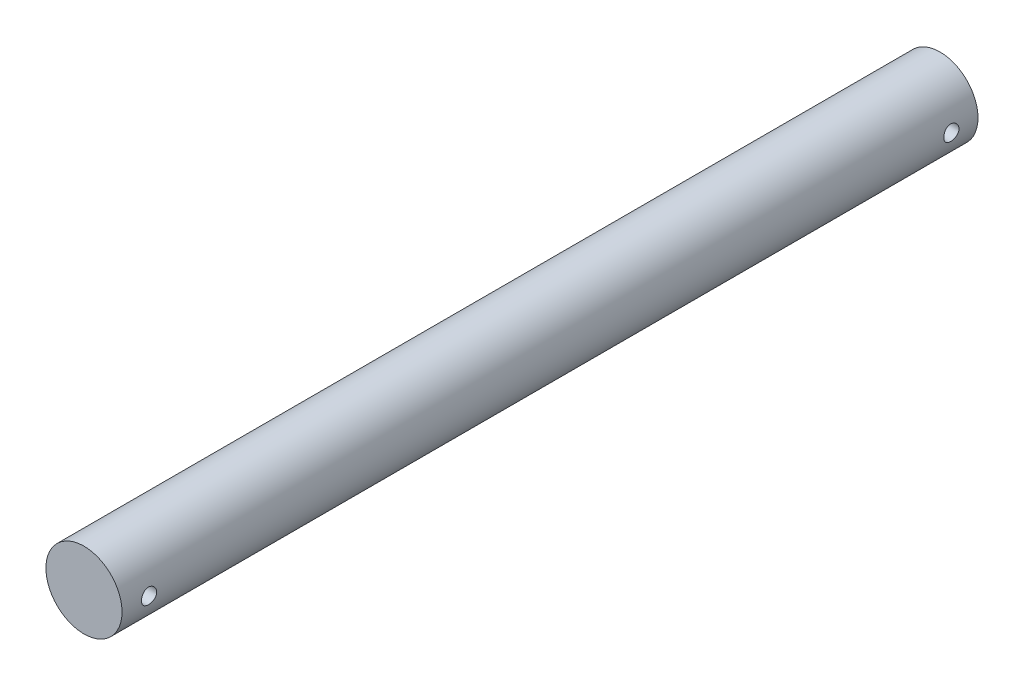
ISO-10303-21;
HEADER;
FILE_DESCRIPTION(('STEP AP214'),'2;1');
FILE_NAME('part.step','',(''),(''),'','','');
FILE_SCHEMA(('AUTOMOTIVE_DESIGN { 1 0 10303 214 1 1 1 1 }'));
ENDSEC;
DATA;
#1=APPLICATION_CONTEXT('core data for automotive mechanical design processes');
#2=APPLICATION_PROTOCOL_DEFINITION('international standard','automotive_design',2000,#1);
#3=PRODUCT_CONTEXT('',#1,'mechanical');
#4=PRODUCT('Part','Part','',(#3));
#5=PRODUCT_RELATED_PRODUCT_CATEGORY('part','',(#4));
#6=PRODUCT_DEFINITION_FORMATION('','',#4);
#7=PRODUCT_DEFINITION_CONTEXT('part definition',#1,'design');
#8=PRODUCT_DEFINITION('design','',#6,#7);
#9=PRODUCT_DEFINITION_SHAPE('','',#8);
#10=(LENGTH_UNIT() NAMED_UNIT(*) SI_UNIT(.MILLI.,.METRE.));
#11=(NAMED_UNIT(*) PLANE_ANGLE_UNIT() SI_UNIT($,.RADIAN.));
#12=(NAMED_UNIT(*) SI_UNIT($,.STERADIAN.) SOLID_ANGLE_UNIT());
#13=UNCERTAINTY_MEASURE_WITH_UNIT(LENGTH_MEASURE(1.E-05),#10,'distance_accuracy_value','');
#14=(GEOMETRIC_REPRESENTATION_CONTEXT(3) GLOBAL_UNCERTAINTY_ASSIGNED_CONTEXT((#13)) GLOBAL_UNIT_ASSIGNED_CONTEXT((#10,
#11,#12)) REPRESENTATION_CONTEXT('',''));
#15=CARTESIAN_POINT('',(0.,0.,0.));
#16=DIRECTION('',(0.,0.,1.));
#17=DIRECTION('',(1.,0.,0.));
#18=AXIS2_PLACEMENT_3D('',#15,#16,#17);
#19=CARTESIAN_POINT('',(0.,0.,450.));
#20=DIRECTION('',(0.,0.,-1.));
#21=DIRECTION('',(-1.,0.,0.));
#22=AXIS2_PLACEMENT_3D('',#19,#20,#21);
#23=CYLINDRICAL_SURFACE('',#22,20.);
#24=CARTESIAN_POINT('',(-20.,0.,439.75));
#25=CARTESIAN_POINT('',(-19.9999959032348,-0.222307627170533,439.749991822007));
#26=CARTESIAN_POINT('',(-19.9962554071292,-0.444718640806089,439.731404628129));
#27=CARTESIAN_POINT('',(-19.9816946249293,-0.883254030756075,439.657605999539));
#28=CARTESIAN_POINT('',(-19.9708687144076,-1.09937327016542,439.602365468794));
#29=CARTESIAN_POINT('',(-19.9433459711314,-1.51892122105325,439.457034905517));
#30=CARTESIAN_POINT('',(-19.9266547630683,-1.72236187173253,439.366978252621));
#31=CARTESIAN_POINT('',(-19.889215921413,-2.11123195545689,439.154671009955));
#32=CARTESIAN_POINT('',(-19.8684685294298,-2.29666246030323,439.032422337571));
#33=CARTESIAN_POINT('',(-19.8248866131972,-2.64677390925944,438.757446022834));
#34=CARTESIAN_POINT('',(-19.8020298201681,-2.81117580463408,438.604366578435));
#35=CARTESIAN_POINT('',(-19.7569672181094,-3.11214702643213,438.272830334433));
#36=CARTESIAN_POINT('',(-19.7347614600387,-3.24871417908175,438.094371554659));
#37=CARTESIAN_POINT('',(-19.6932976724827,-3.49132701339042,437.715135227953));
#38=CARTESIAN_POINT('',(-19.6740682945156,-3.59708375546324,437.514169424816));
#39=CARTESIAN_POINT('',(-19.6410507224189,-3.77322266632144,437.096872723982));
#40=CARTESIAN_POINT('',(-19.6272619907853,-3.84360832974975,436.880543346608));
#41=CARTESIAN_POINT('',(-19.6069122097851,-3.94610119953992,436.441662544369));
#42=CARTESIAN_POINT('',(-19.6002588031638,-3.97869799183395,436.219229823443));
#43=CARTESIAN_POINT('',(-19.5946550013038,-4.00620851090315,435.771960714558));
#44=CARTESIAN_POINT('',(-19.5957038184152,-4.00112609085424,435.547124574727));
#45=CARTESIAN_POINT('',(-19.6053020462212,-3.9538182924077,435.105012847915));
#46=CARTESIAN_POINT('',(-19.6137381144293,-3.91215416097574,434.887674377491));
#47=CARTESIAN_POINT('',(-19.6369818463213,-3.7937515384921,434.463135693348));
#48=CARTESIAN_POINT('',(-19.65178981429,-3.7170113724027,434.255935964324));
#49=CARTESIAN_POINT('',(-19.6862247400376,-3.53009913469891,433.855938953186));
#50=CARTESIAN_POINT('',(-19.7058835925539,-3.41970460492845,433.663248481723));
#51=CARTESIAN_POINT('',(-19.7477847509168,-3.16877429829069,433.298916600109));
#52=CARTESIAN_POINT('',(-19.7700273535331,-3.0282350574273,433.127277612595));
#53=CARTESIAN_POINT('',(-19.81508084966,-2.71799973824232,432.806682390172));
#54=CARTESIAN_POINT('',(-19.8378947684366,-2.54782464484976,432.658189728564));
#55=CARTESIAN_POINT('',(-19.8811539485759,-2.18474009624802,432.391784614795));
#56=CARTESIAN_POINT('',(-19.9015991795588,-1.99183034951755,432.273872554826));
#57=CARTESIAN_POINT('',(-19.9378676064356,-1.58823754751569,432.071889963096));
#58=CARTESIAN_POINT('',(-19.9536835539309,-1.37752727834121,431.987872425422));
#59=CARTESIAN_POINT('',(-19.9788563595143,-0.944595905794671,431.856558103846));
#60=CARTESIAN_POINT('',(-19.9882140000212,-0.722376200289807,431.809256871706));
#61=CARTESIAN_POINT('',(-19.9993068746747,-0.276717622508609,431.753374184823));
#62=CARTESIAN_POINT('',(-20.0011669860988,-0.0533613133023145,431.744158321839));
#63=CARTESIAN_POINT('',(-19.9974020772041,0.391699736770843,431.762999435769));
#64=CARTESIAN_POINT('',(-19.9917774776578,0.613404569775159,431.79105431741));
#65=CARTESIAN_POINT('',(-19.9737532803207,1.04682263978615,431.883113494176));
#66=CARTESIAN_POINT('',(-19.9614150561683,1.25860779335961,431.946792273992));
#67=CARTESIAN_POINT('',(-19.9313420824413,1.66849450999866,432.107935930623));
#68=CARTESIAN_POINT('',(-19.9136069285691,1.86659504655015,432.205403338707));
#69=CARTESIAN_POINT('',(-19.8743964613318,2.24616469474486,432.432729962605));
#70=CARTESIAN_POINT('',(-19.8528780174821,2.42740050700875,432.562971124156));
#71=CARTESIAN_POINT('',(-19.8085893931953,2.76567207647682,432.851636764829));
#72=CARTESIAN_POINT('',(-19.7858190787355,2.92270523572303,433.0100642656));
#73=CARTESIAN_POINT('',(-19.7411721422786,3.21056236309667,433.353493407565));
#74=CARTESIAN_POINT('',(-19.7193144093322,3.34095080979459,433.538862976885));
#75=CARTESIAN_POINT('',(-19.6793676718478,3.56874168020481,433.929245445427));
#76=CARTESIAN_POINT('',(-19.6612785165337,3.6661454236916,434.134257558294));
#77=CARTESIAN_POINT('',(-19.6310696233753,3.82460736632783,434.557072984598));
#78=CARTESIAN_POINT('',(-19.6189189948875,3.88585399916419,434.774803364841));
#79=CARTESIAN_POINT('',(-19.601897471681,3.97083460650878,435.217733813964));
#80=CARTESIAN_POINT('',(-19.5970256276445,3.99457347290044,435.442932904837));
#81=CARTESIAN_POINT('',(-19.5951659852552,4.00368364346986,435.890035458177));
#82=CARTESIAN_POINT('',(-19.598036767572,3.98974315228357,436.111924595708));
#83=CARTESIAN_POINT('',(-19.6110229393846,3.92540921640023,436.55012659962));
#84=CARTESIAN_POINT('',(-19.6211382706868,3.87501606451718,436.766439510779));
#85=CARTESIAN_POINT('',(-19.6474105687663,3.73951427399581,437.186910844962));
#86=CARTESIAN_POINT('',(-19.6635528407532,3.65449002686937,437.39109744201));
#87=CARTESIAN_POINT('',(-19.7000685989668,3.45221857840642,437.782414882938));
#88=CARTESIAN_POINT('',(-19.7204424399558,3.33496867509954,437.969544294901));
#89=CARTESIAN_POINT('',(-19.763558420929,3.06922365914566,438.324862288601));
#90=CARTESIAN_POINT('',(-19.786334916388,2.92023154894071,438.49267506107));
#91=CARTESIAN_POINT('',(-19.8314432748782,2.59625747605254,438.801144822117));
#92=CARTESIAN_POINT('',(-19.8537750345274,2.42126954861333,438.941795561269));
#93=CARTESIAN_POINT('',(-19.8957532955189,2.04807051635298,439.193338575786));
#94=CARTESIAN_POINT('',(-19.9153692487698,1.84963553771933,439.30390401312));
#95=CARTESIAN_POINT('',(-19.9494050034,1.43666544376293,439.489944490386));
#96=CARTESIAN_POINT('',(-19.9638294855446,1.22214504345251,439.56545115813));
#97=CARTESIAN_POINT('',(-19.9830549038148,0.839285955695121,439.664607792179));
#98=CARTESIAN_POINT('',(-19.9893721263381,0.673126656055139,439.696572774831));
#99=CARTESIAN_POINT('',(-19.9978461655957,0.337998100840267,439.739271649433));
#100=CARTESIAN_POINT('',(-20.0000031149262,0.169028934994475,439.750006218039));
#101=CARTESIAN_POINT('',(-20.,0.,439.75));
#102=B_SPLINE_CURVE_WITH_KNOTS('',3,(#24,#25,#26,#27,#28,#29,#30,#31,#32,#33,#34,#35,#36,#37,
#38,#39,#40,#41,#42,#43,#44,#45,#46,#47,#48,#49,#50,#51,#52,#53,#54,#55,#56,#57,#58,#59,#60,#61,
#62,#63,#64,#65,#66,#67,#68,#69,#70,#71,#72,#73,#74,#75,#76,#77,#78,#79,#80,#81,#82,#83,#84,#85,
#86,#87,#88,#89,#90,#91,#92,#93,#94,#95,#96,#97,#98,#99,#100,#101),.UNSPECIFIED.,.T.,.F.,(4,2,2,
2,2,2,2,2,2,2,2,2,2,2,2,2,2,2,2,2,2,2,2,2,2,2,2,2,2,2,2,2,2,2,2,2,2,2,4),(0.,0.666304522645038,
1.33313860276528,1.99933494100134,2.66549160892344,3.33973068044875,4.01402238698946,
4.69444780023686,5.37480597460789,6.04624740416216,6.71762017128675,7.37886908028889,
8.04014957018694,8.7058996081815,9.37172619002464,10.0495300996918,10.7273427016306,
11.4062109941987,12.0849970279592,12.7524294270884,13.4198243063525,14.0812181580667,
14.7426615686787,15.4122026413721,16.0818155338749,16.7616251432068,17.4414075489764,
18.1176152413466,18.7937347332544,19.4575889027459,20.1214377397421,20.7836784501621,
21.4459747033124,22.1195230496035,22.793226181355,23.4739798670632,24.1541182207385,
24.6607510116335,25.1673676548776),.UNSPECIFIED.);
#103=CARTESIAN_POINT('',(-20.,0.,439.75));
#104=VERTEX_POINT('',#103);
#105=EDGE_CURVE('E10',#104,#104,#102,.T.);
#106=ORIENTED_EDGE('',*,*,#105,.T.);
#107=EDGE_LOOP('',(#106));
#108=FACE_BOUND('',#107,.T.);
#109=CARTESIAN_POINT('',(20.,0.,431.75));
#110=CARTESIAN_POINT('',(19.9999959032348,-0.222307627170533,431.750008177993));
#111=CARTESIAN_POINT('',(19.9962554071292,-0.444718640806089,431.768595371871));
#112=CARTESIAN_POINT('',(19.9816946249293,-0.883254030756075,431.842394000461));
#113=CARTESIAN_POINT('',(19.9708687144076,-1.09937327016542,431.897634531206));
#114=CARTESIAN_POINT('',(19.9433459711314,-1.51892122105325,432.042965094483));
#115=CARTESIAN_POINT('',(19.9266547630683,-1.72236187173253,432.133021747379));
#116=CARTESIAN_POINT('',(19.889215921413,-2.11123195545689,432.345328990045));
#117=CARTESIAN_POINT('',(19.8684685294298,-2.29666246030323,432.467577662429));
#118=CARTESIAN_POINT('',(19.8248866131972,-2.64677390925944,432.742553977166));
#119=CARTESIAN_POINT('',(19.8020298201681,-2.81117580463408,432.895633421565));
#120=CARTESIAN_POINT('',(19.7569672181094,-3.11214702643213,433.227169665567));
#121=CARTESIAN_POINT('',(19.7347614600387,-3.24871417908175,433.405628445341));
#122=CARTESIAN_POINT('',(19.6932976724827,-3.49132701339042,433.784864772047));
#123=CARTESIAN_POINT('',(19.6740682945156,-3.59708375546324,433.985830575184));
#124=CARTESIAN_POINT('',(19.6410507224189,-3.77322266632144,434.403127276018));
#125=CARTESIAN_POINT('',(19.6272619907853,-3.84360832974975,434.619456653392));
#126=CARTESIAN_POINT('',(19.6069122097851,-3.94610119953992,435.058337455631));
#127=CARTESIAN_POINT('',(19.6002588031638,-3.97869799183395,435.280770176557));
#128=CARTESIAN_POINT('',(19.5946550013038,-4.00620851090315,435.728039285442));
#129=CARTESIAN_POINT('',(19.5957038184152,-4.00112609085424,435.952875425273));
#130=CARTESIAN_POINT('',(19.6053020462212,-3.9538182924077,436.394987152085));
#131=CARTESIAN_POINT('',(19.6137381144293,-3.91215416097574,436.612325622509));
#132=CARTESIAN_POINT('',(19.6369818463213,-3.7937515384921,437.036864306652));
#133=CARTESIAN_POINT('',(19.65178981429,-3.7170113724027,437.244064035676));
#134=CARTESIAN_POINT('',(19.6862247400376,-3.53009913469891,437.644061046814));
#135=CARTESIAN_POINT('',(19.7058835925539,-3.41970460492845,437.836751518277));
#136=CARTESIAN_POINT('',(19.7477847509168,-3.16877429829069,438.201083399891));
#137=CARTESIAN_POINT('',(19.7700273535331,-3.0282350574273,438.372722387405));
#138=CARTESIAN_POINT('',(19.81508084966,-2.71799973824232,438.693317609828));
#139=CARTESIAN_POINT('',(19.8378947684366,-2.54782464484976,438.841810271437));
#140=CARTESIAN_POINT('',(19.8811539485759,-2.18474009624802,439.108215385205));
#141=CARTESIAN_POINT('',(19.9015991795588,-1.99183034951755,439.226127445174));
#142=CARTESIAN_POINT('',(19.9378676064356,-1.58823754751569,439.428110036904));
#143=CARTESIAN_POINT('',(19.9536835539309,-1.37752727834121,439.512127574578));
#144=CARTESIAN_POINT('',(19.9788563595143,-0.944595905794671,439.643441896154));
#145=CARTESIAN_POINT('',(19.9882140000212,-0.722376200289807,439.690743128295));
#146=CARTESIAN_POINT('',(19.9993068746747,-0.276717622508609,439.746625815177));
#147=CARTESIAN_POINT('',(20.0011669860988,-0.0533613133023145,439.755841678161));
#148=CARTESIAN_POINT('',(19.9974020772041,0.391699736770843,439.737000564231));
#149=CARTESIAN_POINT('',(19.9917774776578,0.613404569775159,439.70894568259));
#150=CARTESIAN_POINT('',(19.9737532803207,1.04682263978615,439.616886505824));
#151=CARTESIAN_POINT('',(19.9614150561683,1.25860779335961,439.553207726008));
#152=CARTESIAN_POINT('',(19.9313420824413,1.66849450999866,439.392064069377));
#153=CARTESIAN_POINT('',(19.9136069285691,1.86659504655015,439.294596661293));
#154=CARTESIAN_POINT('',(19.8743964613318,2.24616469474486,439.067270037395));
#155=CARTESIAN_POINT('',(19.8528780174821,2.42740050700875,438.937028875844));
#156=CARTESIAN_POINT('',(19.8085893931953,2.76567207647682,438.648363235171));
#157=CARTESIAN_POINT('',(19.7858190787355,2.92270523572303,438.489935734401));
#158=CARTESIAN_POINT('',(19.7411721422786,3.21056236309667,438.146506592436));
#159=CARTESIAN_POINT('',(19.7193144093322,3.34095080979459,437.961137023115));
#160=CARTESIAN_POINT('',(19.6793676718478,3.56874168020481,437.570754554573));
#161=CARTESIAN_POINT('',(19.6612785165337,3.6661454236916,437.365742441706));
#162=CARTESIAN_POINT('',(19.6310696233753,3.82460736632783,436.942927015402));
#163=CARTESIAN_POINT('',(19.6189189948875,3.88585399916419,436.725196635159));
#164=CARTESIAN_POINT('',(19.601897471681,3.97083460650878,436.282266186036));
#165=CARTESIAN_POINT('',(19.5970256276445,3.99457347290044,436.057067095163));
#166=CARTESIAN_POINT('',(19.5951659852552,4.00368364346986,435.609964541823));
#167=CARTESIAN_POINT('',(19.598036767572,3.98974315228357,435.388075404292));
#168=CARTESIAN_POINT('',(19.6110229393846,3.92540921640023,434.94987340038));
#169=CARTESIAN_POINT('',(19.6211382706868,3.87501606451718,434.733560489221));
#170=CARTESIAN_POINT('',(19.6474105687663,3.73951427399581,434.313089155038));
#171=CARTESIAN_POINT('',(19.6635528407532,3.65449002686937,434.10890255799));
#172=CARTESIAN_POINT('',(19.7000685989668,3.45221857840642,433.717585117062));
#173=CARTESIAN_POINT('',(19.7204424399558,3.33496867509954,433.530455705099));
#174=CARTESIAN_POINT('',(19.763558420929,3.06922365914566,433.175137711399));
#175=CARTESIAN_POINT('',(19.786334916388,2.92023154894071,433.00732493893));
#176=CARTESIAN_POINT('',(19.8314432748782,2.59625747605254,432.698855177883));
#177=CARTESIAN_POINT('',(19.8537750345274,2.42126954861333,432.558204438731));
#178=CARTESIAN_POINT('',(19.8957532955189,2.04807051635298,432.306661424214));
#179=CARTESIAN_POINT('',(19.9153692487698,1.84963553771933,432.19609598688));
#180=CARTESIAN_POINT('',(19.9494050034,1.43666544376293,432.010055509614));
#181=CARTESIAN_POINT('',(19.9638294855446,1.22214504345251,431.93454884187));
#182=CARTESIAN_POINT('',(19.9830549038148,0.839285955695121,431.835392207821));
#183=CARTESIAN_POINT('',(19.9893721263381,0.673126656055139,431.803427225169));
#184=CARTESIAN_POINT('',(19.9978461655957,0.337998100840267,431.760728350567));
#185=CARTESIAN_POINT('',(20.0000031149262,0.169028934994475,431.749993781961));
#186=CARTESIAN_POINT('',(20.,0.,431.75));
#187=B_SPLINE_CURVE_WITH_KNOTS('',3,(#109,#110,#111,#112,#113,#114,#115,#116,#117,#118,#119,
#120,#121,#122,#123,#124,#125,#126,#127,#128,#129,#130,#131,#132,#133,#134,#135,#136,#137,#138,
#139,#140,#141,#142,#143,#144,#145,#146,#147,#148,#149,#150,#151,#152,#153,#154,#155,#156,#157,
#158,#159,#160,#161,#162,#163,#164,#165,#166,#167,#168,#169,#170,#171,#172,#173,#174,#175,#176,
#177,#178,#179,#180,#181,#182,#183,#184,#185,#186),.UNSPECIFIED.,.T.,.F.,(4,2,2,2,2,2,2,2,2,2,2,
2,2,2,2,2,2,2,2,2,2,2,2,2,2,2,2,2,2,2,2,2,2,2,2,2,2,2,4),(0.,0.666304522645038,1.33313860276528,
1.99933494100134,2.66549160892344,3.33973068044875,4.01402238698946,4.69444780023686,
5.37480597460789,6.04624740416216,6.71762017128675,7.37886908028889,8.04014957018694,
8.7058996081815,9.37172619002464,10.0495300996918,10.7273427016306,11.4062109941987,
12.0849970279592,12.7524294270884,13.4198243063525,14.0812181580667,14.7426615686787,
15.4122026413721,16.0818155338749,16.7616251432068,17.4414075489764,18.1176152413466,
18.7937347332544,19.4575889027459,20.1214377397421,20.7836784501621,21.4459747033124,
22.1195230496035,22.793226181355,23.4739798670632,24.1541182207385,24.6607510116335,
25.1673676548776),.UNSPECIFIED.);
#188=CARTESIAN_POINT('',(20.,0.,431.75));
#189=VERTEX_POINT('',#188);
#190=EDGE_CURVE('E47',#189,#189,#187,.T.);
#191=ORIENTED_EDGE('',*,*,#190,.T.);
#192=EDGE_LOOP('',(#191));
#193=FACE_BOUND('',#192,.T.);
#194=CARTESIAN_POINT('',(-20.,0.,18.));
#195=CARTESIAN_POINT('',(-19.9999959032348,-0.222307627170532,17.9999918220066));
#196=CARTESIAN_POINT('',(-19.9962554071292,-0.444718640806088,17.9814046281294));
#197=CARTESIAN_POINT('',(-19.9816946249293,-0.883254030756076,17.907605999539));
#198=CARTESIAN_POINT('',(-19.9708687144076,-1.09937327016542,17.852365468794));
#199=CARTESIAN_POINT('',(-19.9433459711314,-1.51892122105325,17.7070349055168));
#200=CARTESIAN_POINT('',(-19.9266547630683,-1.72236187173254,17.6169782526213));
#201=CARTESIAN_POINT('',(-19.889215921413,-2.1112319554569,17.4046710099548));
#202=CARTESIAN_POINT('',(-19.8684685294298,-2.29666246030325,17.2824223375711));
#203=CARTESIAN_POINT('',(-19.8248866131972,-2.64677390925946,17.0074460228343));
#204=CARTESIAN_POINT('',(-19.8020298201681,-2.81117580463408,16.8543665784353));
#205=CARTESIAN_POINT('',(-19.7569672181094,-3.11214702643213,16.5228303344331));
#206=CARTESIAN_POINT('',(-19.7347614600387,-3.24871417908176,16.344371554659));
#207=CARTESIAN_POINT('',(-19.6932976724827,-3.49132701339042,15.965135227953));
#208=CARTESIAN_POINT('',(-19.6740682945156,-3.59708375546325,15.7641694248164));
#209=CARTESIAN_POINT('',(-19.6410507224189,-3.77322266632145,15.3468727239819));
#210=CARTESIAN_POINT('',(-19.6272619907853,-3.84360832974976,15.1305433466079));
#211=CARTESIAN_POINT('',(-19.6069122097851,-3.94610119953993,14.6916625443689));
#212=CARTESIAN_POINT('',(-19.6002588031638,-3.97869799183396,14.4692298234434));
#213=CARTESIAN_POINT('',(-19.5946550013038,-4.00620851090316,14.0219607145582));
#214=CARTESIAN_POINT('',(-19.5957038184152,-4.00112609085425,13.7971245747265));
#215=CARTESIAN_POINT('',(-19.6053020462212,-3.9538182924077,13.3550128479153));
#216=CARTESIAN_POINT('',(-19.6137381144293,-3.91215416097574,13.1376743774906));
#217=CARTESIAN_POINT('',(-19.6369818463213,-3.79375153849209,12.7131356933482));
#218=CARTESIAN_POINT('',(-19.65178981429,-3.71701137240269,12.505935964324));
#219=CARTESIAN_POINT('',(-19.6862247400376,-3.53009913469891,12.1059389531856));
#220=CARTESIAN_POINT('',(-19.7058835925539,-3.41970460492847,11.9132484817233));
#221=CARTESIAN_POINT('',(-19.7477847509168,-3.16877429829071,11.5489166001088));
#222=CARTESIAN_POINT('',(-19.7700273535331,-3.02823505742731,11.3772776125954));
#223=CARTESIAN_POINT('',(-19.81508084966,-2.71799973824234,11.0566823901723));
#224=CARTESIAN_POINT('',(-19.8378947684366,-2.54782464484978,10.9081897285635));
#225=CARTESIAN_POINT('',(-19.8811539485759,-2.18474009624804,10.6417846147951));
#226=CARTESIAN_POINT('',(-19.9015991795588,-1.99183034951756,10.5238725548257));
#227=CARTESIAN_POINT('',(-19.9378676064356,-1.58823754751568,10.3218899630961));
#228=CARTESIAN_POINT('',(-19.9536835539309,-1.3775272783412,10.2378724254219));
#229=CARTESIAN_POINT('',(-19.9788563595143,-0.944595905794658,10.1065581038457));
#230=CARTESIAN_POINT('',(-19.9882140000212,-0.722376200289798,10.0592568717055));
#231=CARTESIAN_POINT('',(-19.9993068746747,-0.276717622508602,10.0033741848229));
#232=CARTESIAN_POINT('',(-20.0011669860988,-0.0533613133023047,9.99415832183892));
#233=CARTESIAN_POINT('',(-19.9974020772041,0.391699736770857,10.0129994357687));
#234=CARTESIAN_POINT('',(-19.9917774776578,0.613404569775174,10.0410543174104));
#235=CARTESIAN_POINT('',(-19.9737532803207,1.04682263978616,10.1331134941758));
#236=CARTESIAN_POINT('',(-19.9614150561683,1.25860779335961,10.1967922739916));
#237=CARTESIAN_POINT('',(-19.9313420824413,1.66849450999867,10.3579359306232));
#238=CARTESIAN_POINT('',(-19.9136069285691,1.86659504655016,10.4554033387073));
#239=CARTESIAN_POINT('',(-19.8743964613318,2.24616469474487,10.6827299626053));
#240=CARTESIAN_POINT('',(-19.8528780174821,2.42740050700875,10.8129711241558));
#241=CARTESIAN_POINT('',(-19.8085893931953,2.76567207647683,11.1016367648291));
#242=CARTESIAN_POINT('',(-19.7858190787355,2.92270523572305,11.2600642655995));
#243=CARTESIAN_POINT('',(-19.7411721422786,3.2105623630967,11.6034934075645));
#244=CARTESIAN_POINT('',(-19.7193144093322,3.34095080979462,11.7888629768853));
#245=CARTESIAN_POINT('',(-19.6793676718478,3.56874168020482,12.1792454454267));
#246=CARTESIAN_POINT('',(-19.6612785165337,3.66614542369161,12.3842575582942));
#247=CARTESIAN_POINT('',(-19.6310696233753,3.82460736632784,12.8070729845982));
#248=CARTESIAN_POINT('',(-19.6189189948875,3.8858539991642,13.0248033648413));
#249=CARTESIAN_POINT('',(-19.601897471681,3.97083460650879,13.4677338139636));
#250=CARTESIAN_POINT('',(-19.5970256276445,3.99457347290045,13.6929329048374));
#251=CARTESIAN_POINT('',(-19.5951659852552,4.00368364346987,14.1400354581773));
#252=CARTESIAN_POINT('',(-19.598036767572,3.98974315228358,14.361924595708));
#253=CARTESIAN_POINT('',(-19.6110229393846,3.92540921640024,14.8001265996201));
#254=CARTESIAN_POINT('',(-19.6211382706868,3.87501606451719,15.0164395107792));
#255=CARTESIAN_POINT('',(-19.6474105687663,3.73951427399582,15.4369108449622));
#256=CARTESIAN_POINT('',(-19.6635528407532,3.65449002686938,15.6410974420097));
#257=CARTESIAN_POINT('',(-19.7000685989668,3.45221857840642,16.0324148829378));
#258=CARTESIAN_POINT('',(-19.7204424399558,3.33496867509953,16.2195442949006));
#259=CARTESIAN_POINT('',(-19.763558420929,3.06922365914565,16.5748622886013));
#260=CARTESIAN_POINT('',(-19.786334916388,2.92023154894072,16.7426750610704));
#261=CARTESIAN_POINT('',(-19.8314432748782,2.59625747605256,17.0511448221167));
#262=CARTESIAN_POINT('',(-19.8537750345274,2.42126954861334,17.1917955612691));
#263=CARTESIAN_POINT('',(-19.8957532955189,2.04807051635298,17.4433385757858));
#264=CARTESIAN_POINT('',(-19.9153692487698,1.84963553771934,17.5539040131201));
#265=CARTESIAN_POINT('',(-19.9494050034,1.43666544376293,17.7399444903864));
#266=CARTESIAN_POINT('',(-19.9638294855446,1.2221450434525,17.81545115813));
#267=CARTESIAN_POINT('',(-19.9830549038148,0.839285955695115,17.9146077921789));
#268=CARTESIAN_POINT('',(-19.9893721263381,0.673126656055136,17.946572774831));
#269=CARTESIAN_POINT('',(-19.9978461655957,0.337998100840266,17.9892716494335));
#270=CARTESIAN_POINT('',(-20.0000031149262,0.169028934994475,18.0000062180391));
#271=CARTESIAN_POINT('',(-20.,0.,18.));
#272=B_SPLINE_CURVE_WITH_KNOTS('',3,(#194,#195,#196,#197,#198,#199,#200,#201,#202,#203,#204,
#205,#206,#207,#208,#209,#210,#211,#212,#213,#214,#215,#216,#217,#218,#219,#220,#221,#222,#223,
#224,#225,#226,#227,#228,#229,#230,#231,#232,#233,#234,#235,#236,#237,#238,#239,#240,#241,#242,
#243,#244,#245,#246,#247,#248,#249,#250,#251,#252,#253,#254,#255,#256,#257,#258,#259,#260,#261,
#262,#263,#264,#265,#266,#267,#268,#269,#270,#271),.UNSPECIFIED.,.T.,.F.,(4,2,2,2,2,2,2,2,2,2,2,
2,2,2,2,2,2,2,2,2,2,2,2,2,2,2,2,2,2,2,2,2,2,2,2,2,2,2,4),(0.,0.666304522645034,1.33313860276529,
1.99933494100137,2.66549160892345,3.33973068044875,4.01402238698947,4.69444780023691,
5.3748059746079,6.04624740416218,6.71762017128681,7.37886908028894,8.04014957018699,
8.70589960818151,9.37172619002463,10.0495300996918,10.7273427016306,11.4062109941988,
12.0849970279592,12.7524294270884,13.4198243063525,14.0812181580667,14.7426615686787,
15.4122026413722,16.081815533875,16.7616251432068,17.4414075489765,18.1176152413467,
18.7937347332544,19.4575889027459,20.1214377397421,20.7836784501622,21.4459747033125,
22.1195230496035,22.793226181355,23.4739798670633,24.1541182207386,24.6607510116336,
25.1673676548777),.UNSPECIFIED.);
#273=CARTESIAN_POINT('',(-20.,0.,18.));
#274=VERTEX_POINT('',#273);
#275=EDGE_CURVE('E51',#274,#274,#272,.T.);
#276=ORIENTED_EDGE('',*,*,#275,.T.);
#277=EDGE_LOOP('',(#276));
#278=FACE_BOUND('',#277,.T.);
#279=CARTESIAN_POINT('',(20.,0.,10.));
#280=CARTESIAN_POINT('',(19.9999959032348,-0.222307627170533,10.0000081779934));
#281=CARTESIAN_POINT('',(19.9962554071292,-0.444718640806089,10.0185953718706));
#282=CARTESIAN_POINT('',(19.9816946249293,-0.883254030756078,10.092394000461));
#283=CARTESIAN_POINT('',(19.9708687144076,-1.09937327016542,10.147634531206));
#284=CARTESIAN_POINT('',(19.9433459711314,-1.51892122105325,10.2929650944832));
#285=CARTESIAN_POINT('',(19.9266547630683,-1.72236187173254,10.3830217473787));
#286=CARTESIAN_POINT('',(19.889215921413,-2.1112319554569,10.5953289900452));
#287=CARTESIAN_POINT('',(19.8684685294298,-2.29666246030325,10.7175776624289));
#288=CARTESIAN_POINT('',(19.8248866131972,-2.64677390925946,10.9925539771657));
#289=CARTESIAN_POINT('',(19.8020298201681,-2.81117580463408,11.1456334215647));
#290=CARTESIAN_POINT('',(19.7569672181094,-3.11214702643213,11.4771696655669));
#291=CARTESIAN_POINT('',(19.7347614600387,-3.24871417908176,11.655628445341));
#292=CARTESIAN_POINT('',(19.6932976724827,-3.49132701339042,12.034864772047));
#293=CARTESIAN_POINT('',(19.6740682945156,-3.59708375546325,12.2358305751836));
#294=CARTESIAN_POINT('',(19.6410507224189,-3.77322266632145,12.6531272760181));
#295=CARTESIAN_POINT('',(19.6272619907853,-3.84360832974976,12.8694566533921));
#296=CARTESIAN_POINT('',(19.6069122097851,-3.94610119953993,13.3083374556311));
#297=CARTESIAN_POINT('',(19.6002588031638,-3.97869799183396,13.5307701765566));
#298=CARTESIAN_POINT('',(19.5946550013038,-4.00620851090316,13.9780392854418));
#299=CARTESIAN_POINT('',(19.5957038184152,-4.00112609085425,14.2028754252735));
#300=CARTESIAN_POINT('',(19.6053020462212,-3.9538182924077,14.6449871520847));
#301=CARTESIAN_POINT('',(19.6137381144293,-3.91215416097573,14.8623256225094));
#302=CARTESIAN_POINT('',(19.6369818463213,-3.79375153849209,15.2868643066518));
#303=CARTESIAN_POINT('',(19.65178981429,-3.71701137240269,15.494064035676));
#304=CARTESIAN_POINT('',(19.6862247400376,-3.53009913469891,15.8940610468145));
#305=CARTESIAN_POINT('',(19.7058835925539,-3.41970460492847,16.0867515182767));
#306=CARTESIAN_POINT('',(19.7477847509168,-3.16877429829071,16.4510833998912));
#307=CARTESIAN_POINT('',(19.7700273535331,-3.02823505742731,16.6227223874046));
#308=CARTESIAN_POINT('',(19.81508084966,-2.71799973824234,16.9433176098278));
#309=CARTESIAN_POINT('',(19.8378947684366,-2.54782464484978,17.0918102714365));
#310=CARTESIAN_POINT('',(19.8811539485759,-2.18474009624804,17.3582153852049));
#311=CARTESIAN_POINT('',(19.9015991795588,-1.99183034951756,17.4761274451743));
#312=CARTESIAN_POINT('',(19.9378676064356,-1.58823754751568,17.6781100369039));
#313=CARTESIAN_POINT('',(19.9536835539309,-1.3775272783412,17.7621275745781));
#314=CARTESIAN_POINT('',(19.9788563595143,-0.944595905794661,17.8934418961543));
#315=CARTESIAN_POINT('',(19.9882140000212,-0.722376200289799,17.9407431282945));
#316=CARTESIAN_POINT('',(19.9993068746747,-0.276717622508602,17.9966258151771));
#317=CARTESIAN_POINT('',(20.0011669860988,-0.053361313302305,18.0058416781611));
#318=CARTESIAN_POINT('',(19.9974020772041,0.391699736770856,17.9870005642313));
#319=CARTESIAN_POINT('',(19.9917774776578,0.613404569775173,17.9589456825896));
#320=CARTESIAN_POINT('',(19.9737532803207,1.04682263978616,17.8668865058242));
#321=CARTESIAN_POINT('',(19.9614150561683,1.25860779335961,17.8032077260084));
#322=CARTESIAN_POINT('',(19.9313420824413,1.66849450999867,17.6420640693768));
#323=CARTESIAN_POINT('',(19.9136069285691,1.86659504655016,17.5445966612927));
#324=CARTESIAN_POINT('',(19.8743964613318,2.24616469474487,17.3172700373948));
#325=CARTESIAN_POINT('',(19.8528780174821,2.42740050700875,17.1870288758442));
#326=CARTESIAN_POINT('',(19.8085893931953,2.76567207647683,16.8983632351709));
#327=CARTESIAN_POINT('',(19.7858190787355,2.92270523572305,16.7399357344005));
#328=CARTESIAN_POINT('',(19.7411721422786,3.2105623630967,16.3965065924355));
#329=CARTESIAN_POINT('',(19.7193144093322,3.34095080979462,16.2111370231146));
#330=CARTESIAN_POINT('',(19.6793676718478,3.56874168020482,15.8207545545733));
#331=CARTESIAN_POINT('',(19.6612785165337,3.66614542369161,15.6157424417058));
#332=CARTESIAN_POINT('',(19.6310696233753,3.82460736632784,15.1929270154018));
#333=CARTESIAN_POINT('',(19.6189189948875,3.8858539991642,14.9751966351587));
#334=CARTESIAN_POINT('',(19.601897471681,3.97083460650879,14.5322661860364));
#335=CARTESIAN_POINT('',(19.5970256276445,3.99457347290045,14.3070670951626));
#336=CARTESIAN_POINT('',(19.5951659852552,4.00368364346987,13.8599645418227));
#337=CARTESIAN_POINT('',(19.598036767572,3.98974315228358,13.638075404292));
#338=CARTESIAN_POINT('',(19.6110229393846,3.92540921640024,13.1998734003799));
#339=CARTESIAN_POINT('',(19.6211382706868,3.87501606451719,12.9835604892208));
#340=CARTESIAN_POINT('',(19.6474105687663,3.73951427399582,12.5630891550378));
#341=CARTESIAN_POINT('',(19.6635528407532,3.65449002686938,12.3589025579903));
#342=CARTESIAN_POINT('',(19.7000685989668,3.45221857840642,11.9675851170622));
#343=CARTESIAN_POINT('',(19.7204424399558,3.33496867509953,11.7804557050994));
#344=CARTESIAN_POINT('',(19.763558420929,3.06922365914566,11.4251377113987));
#345=CARTESIAN_POINT('',(19.786334916388,2.92023154894072,11.2573249389296));
#346=CARTESIAN_POINT('',(19.8314432748782,2.59625747605256,10.9488551778833));
#347=CARTESIAN_POINT('',(19.8537750345274,2.42126954861334,10.8082044387309));
#348=CARTESIAN_POINT('',(19.8957532955189,2.04807051635299,10.5566614242142));
#349=CARTESIAN_POINT('',(19.9153692487698,1.84963553771934,10.4460959868799));
#350=CARTESIAN_POINT('',(19.9494050034,1.43666544376293,10.2600555096136));
#351=CARTESIAN_POINT('',(19.9638294855446,1.22214504345251,10.18454884187));
#352=CARTESIAN_POINT('',(19.9830549038148,0.839285955695119,10.0853922078211));
#353=CARTESIAN_POINT('',(19.9893721263381,0.673126656055141,10.053427225169));
#354=CARTESIAN_POINT('',(19.9978461655957,0.33799810084027,10.0107283505665));
#355=CARTESIAN_POINT('',(20.0000031149262,0.169028934994477,9.99999378196093));
#356=CARTESIAN_POINT('',(20.,0.,10.));
#357=B_SPLINE_CURVE_WITH_KNOTS('',3,(#279,#280,#281,#282,#283,#284,#285,#286,#287,#288,#289,
#290,#291,#292,#293,#294,#295,#296,#297,#298,#299,#300,#301,#302,#303,#304,#305,#306,#307,#308,
#309,#310,#311,#312,#313,#314,#315,#316,#317,#318,#319,#320,#321,#322,#323,#324,#325,#326,#327,
#328,#329,#330,#331,#332,#333,#334,#335,#336,#337,#338,#339,#340,#341,#342,#343,#344,#345,#346,
#347,#348,#349,#350,#351,#352,#353,#354,#355,#356),.UNSPECIFIED.,.T.,.F.,(4,2,2,2,2,2,2,2,2,2,2,
2,2,2,2,2,2,2,2,2,2,2,2,2,2,2,2,2,2,2,2,2,2,2,2,2,2,2,4),(0.,0.666304522645034,1.33313860276529,
1.99933494100137,2.66549160892345,3.33973068044875,4.01402238698947,4.69444780023691,
5.3748059746079,6.04624740416218,6.71762017128681,7.37886908028894,8.04014957018699,
8.70589960818151,9.37172619002462,10.0495300996918,10.7273427016306,11.4062109941988,
12.0849970279592,12.7524294270884,13.4198243063525,14.0812181580667,14.7426615686787,
15.4122026413721,16.081815533875,16.7616251432068,17.4414075489765,18.1176152413467,
18.7937347332544,19.4575889027459,20.1214377397421,20.7836784501622,21.4459747033125,
22.1195230496035,22.793226181355,23.4739798670633,24.1541182207385,24.6607510116336,
25.1673676548777),.UNSPECIFIED.);
#358=CARTESIAN_POINT('',(20.,0.,10.));
#359=VERTEX_POINT('',#358);
#360=EDGE_CURVE('E55',#359,#359,#357,.T.);
#361=ORIENTED_EDGE('',*,*,#360,.T.);
#362=EDGE_LOOP('',(#361));
#363=FACE_BOUND('',#362,.T.);
#364=CARTESIAN_POINT('',(0.,0.,450.));
#365=DIRECTION('',(0.,0.,1.));
#366=DIRECTION('',(1.,0.,0.));
#367=AXIS2_PLACEMENT_3D('',#364,#365,#366);
#368=CIRCLE('',#367,20.);
#369=CARTESIAN_POINT('',(20.,0.,450.));
#370=VERTEX_POINT('',#369);
#371=EDGE_CURVE('E83',#370,#370,#368,.T.);
#372=ORIENTED_EDGE('',*,*,#371,.F.);
#373=EDGE_LOOP('',(#372));
#374=FACE_BOUND('',#373,.T.);
#375=CARTESIAN_POINT('',(0.,0.,0.));
#376=DIRECTION('',(0.,0.,1.));
#377=DIRECTION('',(1.,0.,0.));
#378=AXIS2_PLACEMENT_3D('',#375,#376,#377);
#379=CIRCLE('',#378,20.);
#380=CARTESIAN_POINT('',(20.,0.,0.));
#381=VERTEX_POINT('',#380);
#382=EDGE_CURVE('E84',#381,#381,#379,.T.);
#383=ORIENTED_EDGE('',*,*,#382,.T.);
#384=EDGE_LOOP('',(#383));
#385=FACE_BOUND('',#384,.T.);
#386=ADVANCED_FACE('F36',(#108,#193,#278,#363,#374,#385),#23,.T.);
#387=CARTESIAN_POINT('',(0.,0.,450.));
#388=DIRECTION('',(0.,0.,1.));
#389=DIRECTION('',(1.,0.,0.));
#390=AXIS2_PLACEMENT_3D('',#387,#388,#389);
#391=PLANE('',#390);
#392=ORIENTED_EDGE('',*,*,#371,.T.);
#393=EDGE_LOOP('',(#392));
#394=FACE_BOUND('',#393,.T.);
#395=ADVANCED_FACE('F76',(#394),#391,.T.);
#396=CARTESIAN_POINT('',(0.,0.,0.));
#397=DIRECTION('',(0.,0.,1.));
#398=DIRECTION('',(1.,0.,0.));
#399=AXIS2_PLACEMENT_3D('',#396,#397,#398);
#400=PLANE('',#399);
#401=ORIENTED_EDGE('',*,*,#382,.F.);
#402=EDGE_LOOP('',(#401));
#403=FACE_BOUND('',#402,.T.);
#404=ADVANCED_FACE('F74',(#403),#400,.F.);
#405=CARTESIAN_POINT('',(-20.,0.,14.));
#406=DIRECTION('',(1.,0.,0.));
#407=DIRECTION('',(0.,0.,-1.));
#408=AXIS2_PLACEMENT_3D('',#405,#406,#407);
#409=CYLINDRICAL_SURFACE('',#408,4.);
#410=ORIENTED_EDGE('',*,*,#360,.F.);
#411=EDGE_LOOP('',(#410));
#412=FACE_BOUND('',#411,.T.);
#413=ORIENTED_EDGE('',*,*,#275,.F.);
#414=EDGE_LOOP('',(#413));
#415=FACE_BOUND('',#414,.T.);
#416=ADVANCED_FACE('F68',(#412,#415),#409,.F.);
#417=CARTESIAN_POINT('',(-20.,0.,435.75));
#418=DIRECTION('',(1.,0.,0.));
#419=DIRECTION('',(0.,0.,-1.));
#420=AXIS2_PLACEMENT_3D('',#417,#418,#419);
#421=CYLINDRICAL_SURFACE('',#420,3.99999999999999);
#422=ORIENTED_EDGE('',*,*,#190,.F.);
#423=EDGE_LOOP('',(#422));
#424=FACE_BOUND('',#423,.T.);
#425=ORIENTED_EDGE('',*,*,#105,.F.);
#426=EDGE_LOOP('',(#425));
#427=FACE_BOUND('',#426,.T.);
#428=ADVANCED_FACE('F65',(#424,#427),#421,.F.);
#429=CLOSED_SHELL('',(#386,#395,#404,#416,#428));
#430=MANIFOLD_SOLID_BREP('B2',#429);
#431=ADVANCED_BREP_SHAPE_REPRESENTATION('',(#18,#430),#14);
#432=SHAPE_DEFINITION_REPRESENTATION(#9,#431);
ENDSEC;
END-ISO-10303-21;
